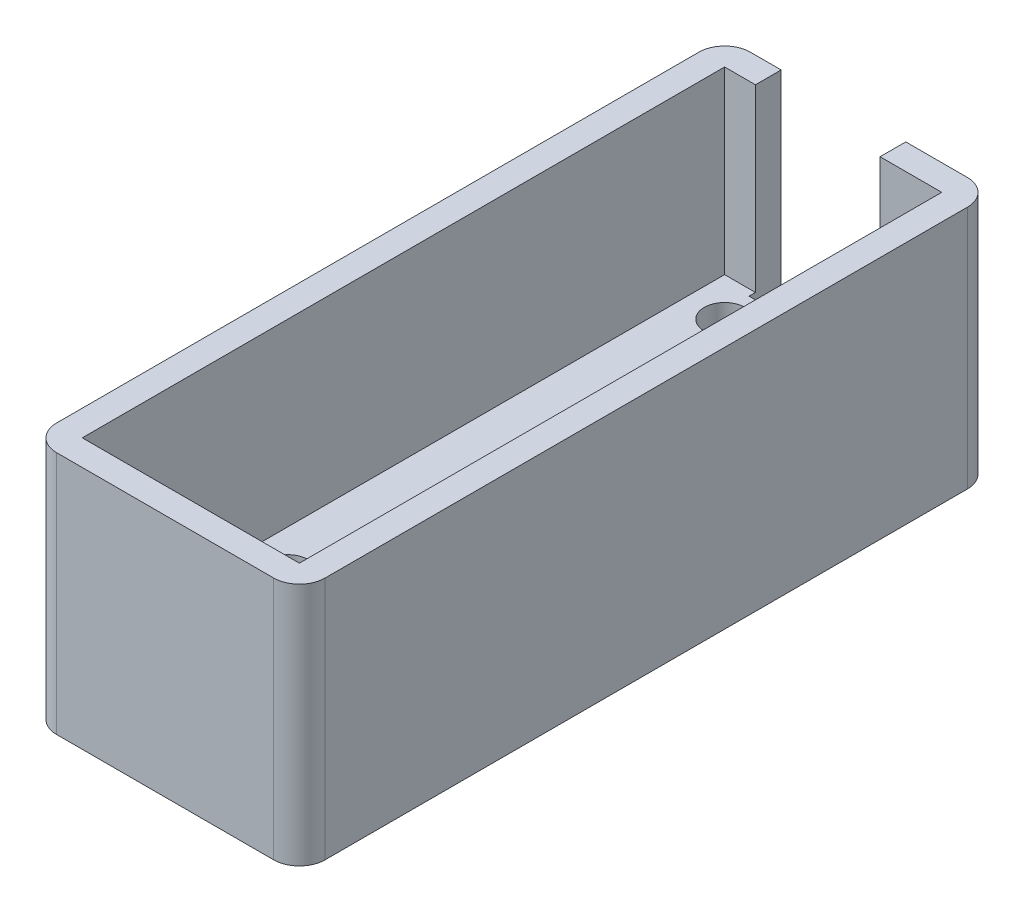
ISO-10303-21;
HEADER;
FILE_DESCRIPTION(('STEP AP214'),'2;1');
FILE_NAME('part.step','',(''),(''),'','','');
FILE_SCHEMA(('AUTOMOTIVE_DESIGN { 1 0 10303 214 1 1 1 1 }'));
ENDSEC;
DATA;
#1=APPLICATION_CONTEXT('core data for automotive mechanical design processes');
#2=APPLICATION_PROTOCOL_DEFINITION('international standard','automotive_design',2000,#1);
#3=PRODUCT_CONTEXT('',#1,'mechanical');
#4=PRODUCT('Part','Part','',(#3));
#5=PRODUCT_RELATED_PRODUCT_CATEGORY('part','',(#4));
#6=PRODUCT_DEFINITION_FORMATION('','',#4);
#7=PRODUCT_DEFINITION_CONTEXT('part definition',#1,'design');
#8=PRODUCT_DEFINITION('design','',#6,#7);
#9=PRODUCT_DEFINITION_SHAPE('','',#8);
#10=(LENGTH_UNIT() NAMED_UNIT(*) SI_UNIT(.MILLI.,.METRE.));
#11=(NAMED_UNIT(*) PLANE_ANGLE_UNIT() SI_UNIT($,.RADIAN.));
#12=(NAMED_UNIT(*) SI_UNIT($,.STERADIAN.) SOLID_ANGLE_UNIT());
#13=UNCERTAINTY_MEASURE_WITH_UNIT(LENGTH_MEASURE(1.E-05),#10,'distance_accuracy_value','');
#14=(GEOMETRIC_REPRESENTATION_CONTEXT(3) GLOBAL_UNCERTAINTY_ASSIGNED_CONTEXT((#13)) GLOBAL_UNIT_ASSIGNED_CONTEXT((#10,
#11,#12)) REPRESENTATION_CONTEXT('',''));
#15=CARTESIAN_POINT('',(0.,0.,0.));
#16=DIRECTION('',(0.,0.,1.));
#17=DIRECTION('',(1.,0.,0.));
#18=AXIS2_PLACEMENT_3D('',#15,#16,#17);
#19=CARTESIAN_POINT('',(21.463,17.78,0.));
#20=DIRECTION('',(1.,0.,0.));
#21=DIRECTION('',(0.,0.,-1.));
#22=AXIS2_PLACEMENT_3D('',#19,#20,#21);
#23=PLANE('',#22);
#24=DIRECTION('',(0.,-1.,0.));
#25=VECTOR('',#24,1.);
#26=CARTESIAN_POINT('',(21.463,5.08,-12.7));
#27=LINE('',#26,#25);
#28=CARTESIAN_POINT('',(21.463,2.54,-12.7));
#29=VERTEX_POINT('',#28);
#30=CARTESIAN_POINT('',(21.463,0.,-12.7));
#31=VERTEX_POINT('',#30);
#32=EDGE_CURVE('E304',#29,#31,#27,.T.);
#33=ORIENTED_EDGE('',*,*,#32,.F.);
#34=CARTESIAN_POINT('',(21.463,2.54,-10.16));
#35=DIRECTION('',(1.,0.,0.));
#36=DIRECTION('',(0.,0.,-1.));
#37=AXIS2_PLACEMENT_3D('',#34,#35,#36);
#38=CIRCLE('',#37,2.54);
#39=CARTESIAN_POINT('',(21.463,5.08,-10.16));
#40=VERTEX_POINT('',#39);
#41=EDGE_CURVE('E11',#29,#40,#38,.T.);
#42=ORIENTED_EDGE('',*,*,#41,.T.);
#43=DIRECTION('',(0.,0.,-1.));
#44=VECTOR('',#43,1.);
#45=CARTESIAN_POINT('',(21.463,5.08,0.));
#46=LINE('',#45,#44);
#47=CARTESIAN_POINT('',(21.463,5.08,0.));
#48=VERTEX_POINT('',#47);
#49=EDGE_CURVE('E210',#48,#40,#46,.T.);
#50=ORIENTED_EDGE('',*,*,#49,.F.);
#51=DIRECTION('',(0.,-1.,0.));
#52=VECTOR('',#51,1.);
#53=CARTESIAN_POINT('',(21.463,17.78,0.));
#54=LINE('',#53,#52);
#55=CARTESIAN_POINT('',(21.463,17.78,0.));
#56=VERTEX_POINT('',#55);
#57=EDGE_CURVE('E209',#56,#48,#54,.T.);
#58=ORIENTED_EDGE('',*,*,#57,.F.);
#59=DIRECTION('',(0.,0.,1.));
#60=VECTOR('',#59,1.);
#61=CARTESIAN_POINT('',(21.463,17.78,0.));
#62=LINE('',#61,#60);
#63=CARTESIAN_POINT('',(21.463,17.78,-63.5));
#64=VERTEX_POINT('',#63);
#65=EDGE_CURVE('E367',#64,#56,#62,.T.);
#66=ORIENTED_EDGE('',*,*,#65,.F.);
#67=DIRECTION('',(0.,-1.,0.));
#68=VECTOR('',#67,1.);
#69=CARTESIAN_POINT('',(21.463,17.78,-63.5));
#70=LINE('',#69,#68);
#71=CARTESIAN_POINT('',(21.463,0.,-63.5));
#72=VERTEX_POINT('',#71);
#73=EDGE_CURVE('E218',#64,#72,#70,.T.);
#74=ORIENTED_EDGE('',*,*,#73,.T.);
#75=DIRECTION('',(0.,0.,1.));
#76=VECTOR('',#75,1.);
#77=CARTESIAN_POINT('',(21.463,0.,0.));
#78=LINE('',#77,#76);
#79=EDGE_CURVE('E375',#72,#31,#78,.T.);
#80=ORIENTED_EDGE('',*,*,#79,.T.);
#81=EDGE_LOOP('',(#33,#42,#50,#58,#66,#74,#80));
#82=FACE_BOUND('',#81,.T.);
#83=ADVANCED_FACE('F49',(#82),#23,.F.);
#84=CARTESIAN_POINT('',(0.,17.78,0.));
#85=DIRECTION('',(-1.,0.,0.));
#86=DIRECTION('',(0.,0.,1.));
#87=AXIS2_PLACEMENT_3D('',#84,#85,#86);
#88=PLANE('',#87);
#89=DIRECTION('',(0.,0.,1.));
#90=VECTOR('',#89,1.);
#91=CARTESIAN_POINT('',(0.,5.08,-12.7));
#92=LINE('',#91,#90);
#93=CARTESIAN_POINT('',(0.,5.08,-10.16));
#94=VERTEX_POINT('',#93);
#95=CARTESIAN_POINT('',(0.,5.08,0.));
#96=VERTEX_POINT('',#95);
#97=EDGE_CURVE('E191',#94,#96,#92,.T.);
#98=ORIENTED_EDGE('',*,*,#97,.F.);
#99=CARTESIAN_POINT('',(0.,2.54,-10.16));
#100=DIRECTION('',(-1.,0.,0.));
#101=DIRECTION('',(0.,0.,1.));
#102=AXIS2_PLACEMENT_3D('',#99,#100,#101);
#103=CIRCLE('',#102,2.54);
#104=CARTESIAN_POINT('',(0.,2.54,-12.7));
#105=VERTEX_POINT('',#104);
#106=EDGE_CURVE('E58',#94,#105,#103,.T.);
#107=ORIENTED_EDGE('',*,*,#106,.T.);
#108=DIRECTION('',(0.,-1.,0.));
#109=VECTOR('',#108,1.);
#110=CARTESIAN_POINT('',(0.,5.08,-12.7));
#111=LINE('',#110,#109);
#112=CARTESIAN_POINT('',(0.,0.,-12.7));
#113=VERTEX_POINT('',#112);
#114=EDGE_CURVE('E300',#105,#113,#111,.T.);
#115=ORIENTED_EDGE('',*,*,#114,.T.);
#116=DIRECTION('',(0.,0.,-1.));
#117=VECTOR('',#116,1.);
#118=CARTESIAN_POINT('',(0.,0.,0.));
#119=LINE('',#118,#117);
#120=CARTESIAN_POINT('',(0.,0.,-63.5));
#121=VERTEX_POINT('',#120);
#122=EDGE_CURVE('E354',#113,#121,#119,.T.);
#123=ORIENTED_EDGE('',*,*,#122,.T.);
#124=DIRECTION('',(0.,-1.,0.));
#125=VECTOR('',#124,1.);
#126=CARTESIAN_POINT('',(0.,17.78,-63.5));
#127=LINE('',#126,#125);
#128=CARTESIAN_POINT('',(0.,17.78,-63.5));
#129=VERTEX_POINT('',#128);
#130=EDGE_CURVE('E216',#129,#121,#127,.T.);
#131=ORIENTED_EDGE('',*,*,#130,.F.);
#132=DIRECTION('',(0.,0.,-1.));
#133=VECTOR('',#132,1.);
#134=CARTESIAN_POINT('',(0.,17.78,0.));
#135=LINE('',#134,#133);
#136=CARTESIAN_POINT('',(0.,17.78,0.));
#137=VERTEX_POINT('',#136);
#138=EDGE_CURVE('E214',#137,#129,#135,.T.);
#139=ORIENTED_EDGE('',*,*,#138,.F.);
#140=DIRECTION('',(0.,-1.,0.));
#141=VECTOR('',#140,1.);
#142=CARTESIAN_POINT('',(0.,17.78,0.));
#143=LINE('',#142,#141);
#144=EDGE_CURVE('E206',#137,#96,#143,.T.);
#145=ORIENTED_EDGE('',*,*,#144,.T.);
#146=EDGE_LOOP('',(#98,#107,#115,#123,#131,#139,#145));
#147=FACE_BOUND('',#146,.T.);
#148=ADVANCED_FACE('F212',(#147),#88,.F.);
#149=CARTESIAN_POINT('',(0.,0.,0.));
#150=DIRECTION('',(0.,1.,0.));
#151=DIRECTION('',(0.,0.,1.));
#152=AXIS2_PLACEMENT_3D('',#149,#150,#151);
#153=PLANE('',#152);
#154=CARTESIAN_POINT('',(3.81,0.,-16.51));
#155=DIRECTION('',(0.,1.,0.));
#156=DIRECTION('',(0.,0.,1.));
#157=AXIS2_PLACEMENT_3D('',#154,#155,#156);
#158=CIRCLE('',#157,2.0193);
#159=CARTESIAN_POINT('',(3.81,0.,-14.4907));
#160=VERTEX_POINT('',#159);
#161=EDGE_CURVE('E773',#160,#160,#158,.T.);
#162=ORIENTED_EDGE('',*,*,#161,.F.);
#163=EDGE_LOOP('',(#162));
#164=FACE_BOUND('',#163,.T.);
#165=CARTESIAN_POINT('',(17.653,0.,-16.51));
#166=DIRECTION('',(0.,1.,0.));
#167=DIRECTION('',(0.,0.,1.));
#168=AXIS2_PLACEMENT_3D('',#165,#166,#167);
#169=CIRCLE('',#168,2.0193);
#170=CARTESIAN_POINT('',(17.653,0.,-14.4907));
#171=VERTEX_POINT('',#170);
#172=EDGE_CURVE('E290',#171,#171,#169,.T.);
#173=ORIENTED_EDGE('',*,*,#172,.F.);
#174=EDGE_LOOP('',(#173));
#175=FACE_BOUND('',#174,.T.);
#176=CARTESIAN_POINT('',(17.653,0.,-59.69));
#177=DIRECTION('',(0.,1.,0.));
#178=DIRECTION('',(0.,0.,1.));
#179=AXIS2_PLACEMENT_3D('',#176,#177,#178);
#180=CIRCLE('',#179,2.0193);
#181=CARTESIAN_POINT('',(17.653,0.,-57.6707));
#182=VERTEX_POINT('',#181);
#183=EDGE_CURVE('E279',#182,#182,#180,.T.);
#184=ORIENTED_EDGE('',*,*,#183,.F.);
#185=EDGE_LOOP('',(#184));
#186=FACE_BOUND('',#185,.T.);
#187=CARTESIAN_POINT('',(3.81,0.,-59.69));
#188=DIRECTION('',(0.,1.,0.));
#189=DIRECTION('',(0.,0.,1.));
#190=AXIS2_PLACEMENT_3D('',#187,#188,#189);
#191=CIRCLE('',#190,2.0193);
#192=CARTESIAN_POINT('',(3.81,0.,-57.6707));
#193=VERTEX_POINT('',#192);
#194=EDGE_CURVE('E276',#193,#193,#191,.T.);
#195=ORIENTED_EDGE('',*,*,#194,.F.);
#196=EDGE_LOOP('',(#195));
#197=FACE_BOUND('',#196,.T.);
#198=ORIENTED_EDGE('',*,*,#122,.F.);
#199=DIRECTION('',(-1.,0.,0.));
#200=VECTOR('',#199,1.);
#201=CARTESIAN_POINT('',(0.,0.,-12.7));
#202=LINE('',#201,#200);
#203=EDGE_CURVE('E200',#31,#113,#202,.T.);
#204=ORIENTED_EDGE('',*,*,#203,.F.);
#205=ORIENTED_EDGE('',*,*,#79,.F.);
#206=DIRECTION('',(1.,0.,0.));
#207=VECTOR('',#206,1.);
#208=CARTESIAN_POINT('',(0.,0.,-63.5));
#209=LINE('',#208,#207);
#210=CARTESIAN_POINT('',(15.367,0.,-63.5));
#211=VERTEX_POINT('',#210);
#212=EDGE_CURVE('E349',#211,#72,#209,.T.);
#213=ORIENTED_EDGE('',*,*,#212,.F.);
#214=DIRECTION('',(0.,0.,-1.));
#215=VECTOR('',#214,1.);
#216=CARTESIAN_POINT('',(15.367,0.,0.));
#217=LINE('',#216,#215);
#218=CARTESIAN_POINT('',(15.367,0.,-62.865));
#219=VERTEX_POINT('',#218);
#220=EDGE_CURVE('E232',#219,#211,#217,.T.);
#221=ORIENTED_EDGE('',*,*,#220,.F.);
#222=DIRECTION('',(-1.,0.,0.));
#223=VECTOR('',#222,1.);
#224=CARTESIAN_POINT('',(0.,0.,-62.865));
#225=LINE('',#224,#223);
#226=CARTESIAN_POINT('',(3.048,0.,-62.865));
#227=VERTEX_POINT('',#226);
#228=EDGE_CURVE('E226',#219,#227,#225,.T.);
#229=ORIENTED_EDGE('',*,*,#228,.T.);
#230=DIRECTION('',(0.,0.,1.));
#231=VECTOR('',#230,1.);
#232=CARTESIAN_POINT('',(3.048,0.,0.));
#233=LINE('',#232,#231);
#234=CARTESIAN_POINT('',(3.048,0.,-63.5));
#235=VERTEX_POINT('',#234);
#236=EDGE_CURVE('E229',#235,#227,#233,.T.);
#237=ORIENTED_EDGE('',*,*,#236,.F.);
#238=EDGE_CURVE('E372',#121,#235,#209,.T.);
#239=ORIENTED_EDGE('',*,*,#238,.F.);
#240=EDGE_LOOP('',(#198,#204,#205,#213,#221,#229,#237,#239));
#241=FACE_BOUND('',#240,.T.);
#242=ADVANCED_FACE('F383',(#164,#175,#186,#197,#241),#153,.T.);
#243=CARTESIAN_POINT('',(0.,17.78,-63.5));
#244=DIRECTION('',(0.,0.,-1.));
#245=DIRECTION('',(-1.,0.,0.));
#246=AXIS2_PLACEMENT_3D('',#243,#244,#245);
#247=PLANE('',#246);
#248=DIRECTION('',(1.,0.,0.));
#249=VECTOR('',#248,1.);
#250=CARTESIAN_POINT('',(0.,17.78,-63.5));
#251=LINE('',#250,#249);
#252=CARTESIAN_POINT('',(15.367,17.78,-63.5));
#253=VERTEX_POINT('',#252);
#254=EDGE_CURVE('E363',#253,#64,#251,.T.);
#255=ORIENTED_EDGE('',*,*,#254,.F.);
#256=DIRECTION('',(0.,-1.,0.));
#257=VECTOR('',#256,1.);
#258=CARTESIAN_POINT('',(15.367,17.78,-63.5));
#259=LINE('',#258,#257);
#260=EDGE_CURVE('E334',#253,#211,#259,.T.);
#261=ORIENTED_EDGE('',*,*,#260,.T.);
#262=ORIENTED_EDGE('',*,*,#212,.T.);
#263=ORIENTED_EDGE('',*,*,#73,.F.);
#264=EDGE_LOOP('',(#255,#261,#262,#263));
#265=FACE_BOUND('',#264,.T.);
#266=ADVANCED_FACE('F422',(#265),#247,.F.);
#267=ORIENTED_EDGE('',*,*,#238,.T.);
#268=DIRECTION('',(0.,1.,0.));
#269=VECTOR('',#268,1.);
#270=CARTESIAN_POINT('',(3.048,17.78,-63.5));
#271=LINE('',#270,#269);
#272=CARTESIAN_POINT('',(3.048,17.78,-63.5));
#273=VERTEX_POINT('',#272);
#274=EDGE_CURVE('E325',#235,#273,#271,.T.);
#275=ORIENTED_EDGE('',*,*,#274,.T.);
#276=EDGE_CURVE('E364',#129,#273,#251,.T.);
#277=ORIENTED_EDGE('',*,*,#276,.F.);
#278=ORIENTED_EDGE('',*,*,#130,.T.);
#279=EDGE_LOOP('',(#267,#275,#277,#278));
#280=FACE_BOUND('',#279,.T.);
#281=ADVANCED_FACE('F385',(#280),#247,.F.);
#282=CARTESIAN_POINT('',(0.,17.78,0.));
#283=DIRECTION('',(0.,0.,-1.));
#284=DIRECTION('',(-1.,0.,0.));
#285=AXIS2_PLACEMENT_3D('',#282,#283,#284);
#286=PLANE('',#285);
#287=DIRECTION('',(1.,0.,0.));
#288=VECTOR('',#287,1.);
#289=CARTESIAN_POINT('',(0.,5.08,0.));
#290=LINE('',#289,#288);
#291=EDGE_CURVE('E195',#96,#48,#290,.T.);
#292=ORIENTED_EDGE('',*,*,#291,.F.);
#293=ORIENTED_EDGE('',*,*,#144,.F.);
#294=DIRECTION('',(1.,0.,0.));
#295=VECTOR('',#294,1.);
#296=CARTESIAN_POINT('',(0.,17.78,0.));
#297=LINE('',#296,#295);
#298=EDGE_CURVE('E369',#137,#56,#297,.T.);
#299=ORIENTED_EDGE('',*,*,#298,.T.);
#300=ORIENTED_EDGE('',*,*,#57,.T.);
#301=EDGE_LOOP('',(#292,#293,#299,#300));
#302=FACE_BOUND('',#301,.T.);
#303=ADVANCED_FACE('F204',(#302),#286,.T.);
#304=CARTESIAN_POINT('',(-2.54,17.78,0.));
#305=DIRECTION('',(-1.,0.,0.));
#306=DIRECTION('',(0.,0.,1.));
#307=AXIS2_PLACEMENT_3D('',#304,#305,#306);
#308=PLANE('',#307);
#309=DIRECTION('',(0.,0.,-1.));
#310=VECTOR('',#309,1.);
#311=CARTESIAN_POINT('',(-2.54,17.78,0.));
#312=LINE('',#311,#310);
#313=CARTESIAN_POINT('',(-2.54,17.78,0.));
#314=VERTEX_POINT('',#313);
#315=CARTESIAN_POINT('',(-2.54,17.78,-63.5));
#316=VERTEX_POINT('',#315);
#317=EDGE_CURVE('E350',#314,#316,#312,.T.);
#318=ORIENTED_EDGE('',*,*,#317,.T.);
#319=DIRECTION('',(0.,-1.,0.));
#320=VECTOR('',#319,1.);
#321=CARTESIAN_POINT('',(-2.54,17.78,-63.5));
#322=LINE('',#321,#320);
#323=CARTESIAN_POINT('',(-2.54,-6.35,-63.5));
#324=VERTEX_POINT('',#323);
#325=EDGE_CURVE('E236',#316,#324,#322,.T.);
#326=ORIENTED_EDGE('',*,*,#325,.T.);
#327=DIRECTION('',(0.,0.,-1.));
#328=VECTOR('',#327,1.);
#329=CARTESIAN_POINT('',(-2.54,-6.35,0.));
#330=LINE('',#329,#328);
#331=CARTESIAN_POINT('',(-2.54,-6.35,0.));
#332=VERTEX_POINT('',#331);
#333=EDGE_CURVE('E337',#332,#324,#330,.T.);
#334=ORIENTED_EDGE('',*,*,#333,.F.);
#335=DIRECTION('',(0.,-1.,0.));
#336=VECTOR('',#335,1.);
#337=CARTESIAN_POINT('',(-2.54,17.78,0.));
#338=LINE('',#337,#336);
#339=EDGE_CURVE('E234',#332,#314,#338,.F.);
#340=ORIENTED_EDGE('',*,*,#339,.T.);
#341=EDGE_LOOP('',(#318,#326,#334,#340));
#342=FACE_BOUND('',#341,.T.);
#343=ADVANCED_FACE('F434',(#342),#308,.T.);
#344=CARTESIAN_POINT('',(0.,17.78,2.54));
#345=DIRECTION('',(0.,0.,-1.));
#346=DIRECTION('',(-1.,0.,0.));
#347=AXIS2_PLACEMENT_3D('',#344,#345,#346);
#348=PLANE('',#347);
#349=DIRECTION('',(1.,0.,0.));
#350=VECTOR('',#349,1.);
#351=CARTESIAN_POINT('',(0.,-6.35,2.54));
#352=LINE('',#351,#350);
#353=CARTESIAN_POINT('',(0.,-6.35,2.54));
#354=VERTEX_POINT('',#353);
#355=CARTESIAN_POINT('',(21.463,-6.35,2.54));
#356=VERTEX_POINT('',#355);
#357=EDGE_CURVE('E340',#354,#356,#352,.T.);
#358=ORIENTED_EDGE('',*,*,#357,.T.);
#359=DIRECTION('',(0.,-1.,0.));
#360=VECTOR('',#359,1.);
#361=CARTESIAN_POINT('',(21.463,17.78,2.54));
#362=LINE('',#361,#360);
#363=CARTESIAN_POINT('',(21.463,17.78,2.54));
#364=VERTEX_POINT('',#363);
#365=EDGE_CURVE('E270',#356,#364,#362,.F.);
#366=ORIENTED_EDGE('',*,*,#365,.T.);
#367=DIRECTION('',(1.,0.,0.));
#368=VECTOR('',#367,1.);
#369=CARTESIAN_POINT('',(0.,17.78,2.54));
#370=LINE('',#369,#368);
#371=CARTESIAN_POINT('',(0.,17.78,2.54));
#372=VERTEX_POINT('',#371);
#373=EDGE_CURVE('E353',#372,#364,#370,.T.);
#374=ORIENTED_EDGE('',*,*,#373,.F.);
#375=DIRECTION('',(0.,-1.,0.));
#376=VECTOR('',#375,1.);
#377=CARTESIAN_POINT('',(0.,-6.35,2.54));
#378=LINE('',#377,#376);
#379=EDGE_CURVE('E267',#372,#354,#378,.T.);
#380=ORIENTED_EDGE('',*,*,#379,.T.);
#381=EDGE_LOOP('',(#358,#366,#374,#380));
#382=FACE_BOUND('',#381,.T.);
#383=ADVANCED_FACE('F430',(#382),#348,.F.);
#384=CARTESIAN_POINT('',(24.003,17.78,0.));
#385=DIRECTION('',(1.,0.,0.));
#386=DIRECTION('',(0.,0.,-1.));
#387=AXIS2_PLACEMENT_3D('',#384,#385,#386);
#388=PLANE('',#387);
#389=DIRECTION('',(0.,0.,1.));
#390=VECTOR('',#389,1.);
#391=CARTESIAN_POINT('',(24.003,-6.35,0.));
#392=LINE('',#391,#390);
#393=CARTESIAN_POINT('',(24.003,-6.35,-63.5));
#394=VERTEX_POINT('',#393);
#395=CARTESIAN_POINT('',(24.003,-6.35,0.));
#396=VERTEX_POINT('',#395);
#397=EDGE_CURVE('E343',#394,#396,#392,.T.);
#398=ORIENTED_EDGE('',*,*,#397,.F.);
#399=DIRECTION('',(0.,-1.,0.));
#400=VECTOR('',#399,1.);
#401=CARTESIAN_POINT('',(24.003,17.78,-63.5));
#402=LINE('',#401,#400);
#403=CARTESIAN_POINT('',(24.003,17.78,-63.5));
#404=VERTEX_POINT('',#403);
#405=EDGE_CURVE('E265',#394,#404,#402,.F.);
#406=ORIENTED_EDGE('',*,*,#405,.T.);
#407=DIRECTION('',(0.,0.,1.));
#408=VECTOR('',#407,1.);
#409=CARTESIAN_POINT('',(24.003,17.78,0.));
#410=LINE('',#409,#408);
#411=CARTESIAN_POINT('',(24.003,17.78,0.));
#412=VERTEX_POINT('',#411);
#413=EDGE_CURVE('E357',#404,#412,#410,.T.);
#414=ORIENTED_EDGE('',*,*,#413,.T.);
#415=DIRECTION('',(0.,-1.,0.));
#416=VECTOR('',#415,1.);
#417=CARTESIAN_POINT('',(24.003,-6.35,0.));
#418=LINE('',#417,#416);
#419=EDGE_CURVE('E262',#412,#396,#418,.T.);
#420=ORIENTED_EDGE('',*,*,#419,.T.);
#421=EDGE_LOOP('',(#398,#406,#414,#420));
#422=FACE_BOUND('',#421,.T.);
#423=ADVANCED_FACE('F426',(#422),#388,.T.);
#424=CARTESIAN_POINT('',(0.,17.78,-66.04));
#425=DIRECTION('',(0.,0.,-1.));
#426=DIRECTION('',(-1.,0.,0.));
#427=AXIS2_PLACEMENT_3D('',#424,#425,#426);
#428=PLANE('',#427);
#429=DIRECTION('',(1.,0.,0.));
#430=VECTOR('',#429,1.);
#431=CARTESIAN_POINT('',(0.,-6.35,-66.04));
#432=LINE('',#431,#430);
#433=CARTESIAN_POINT('',(0.,-6.35,-66.04));
#434=VERTEX_POINT('',#433);
#435=CARTESIAN_POINT('',(21.463,-6.35,-66.04));
#436=VERTEX_POINT('',#435);
#437=EDGE_CURVE('E346',#434,#436,#432,.T.);
#438=ORIENTED_EDGE('',*,*,#437,.F.);
#439=DIRECTION('',(0.,-1.,0.));
#440=VECTOR('',#439,1.);
#441=CARTESIAN_POINT('',(0.,17.78,-66.04));
#442=LINE('',#441,#440);
#443=CARTESIAN_POINT('',(0.,17.78,-66.04));
#444=VERTEX_POINT('',#443);
#445=EDGE_CURVE('E250',#434,#444,#442,.F.);
#446=ORIENTED_EDGE('',*,*,#445,.T.);
#447=DIRECTION('',(1.,0.,0.));
#448=VECTOR('',#447,1.);
#449=CARTESIAN_POINT('',(0.,17.78,-66.04));
#450=LINE('',#449,#448);
#451=CARTESIAN_POINT('',(3.048,17.78,-66.04));
#452=VERTEX_POINT('',#451);
#453=EDGE_CURVE('E361',#444,#452,#450,.T.);
#454=ORIENTED_EDGE('',*,*,#453,.T.);
#455=DIRECTION('',(0.,1.,0.));
#456=VECTOR('',#455,1.);
#457=CARTESIAN_POINT('',(3.048,17.78,-66.04));
#458=LINE('',#457,#456);
#459=CARTESIAN_POINT('',(3.048,-0.635,-66.04));
#460=VERTEX_POINT('',#459);
#461=EDGE_CURVE('E310',#460,#452,#458,.T.);
#462=ORIENTED_EDGE('',*,*,#461,.F.);
#463=DIRECTION('',(-1.,0.,0.));
#464=VECTOR('',#463,1.);
#465=CARTESIAN_POINT('',(15.367,-0.635,-66.04));
#466=LINE('',#465,#464);
#467=CARTESIAN_POINT('',(15.367,-0.635,-66.04));
#468=VERTEX_POINT('',#467);
#469=EDGE_CURVE('E318',#468,#460,#466,.T.);
#470=ORIENTED_EDGE('',*,*,#469,.F.);
#471=DIRECTION('',(0.,-1.,0.));
#472=VECTOR('',#471,1.);
#473=CARTESIAN_POINT('',(15.367,17.78,-66.04));
#474=LINE('',#473,#472);
#475=CARTESIAN_POINT('',(15.367,17.78,-66.04));
#476=VERTEX_POINT('',#475);
#477=EDGE_CURVE('E306',#476,#468,#474,.T.);
#478=ORIENTED_EDGE('',*,*,#477,.F.);
#479=CARTESIAN_POINT('',(21.463,17.78,-66.04));
#480=VERTEX_POINT('',#479);
#481=EDGE_CURVE('E360',#476,#480,#450,.T.);
#482=ORIENTED_EDGE('',*,*,#481,.T.);
#483=DIRECTION('',(0.,-1.,0.));
#484=VECTOR('',#483,1.);
#485=CARTESIAN_POINT('',(21.463,17.78,-66.04));
#486=LINE('',#485,#484);
#487=EDGE_CURVE('E247',#480,#436,#486,.T.);
#488=ORIENTED_EDGE('',*,*,#487,.T.);
#489=EDGE_LOOP('',(#438,#446,#454,#462,#470,#478,#482,#488));
#490=FACE_BOUND('',#489,.T.);
#491=ADVANCED_FACE('F423',(#490),#428,.T.);
#492=CARTESIAN_POINT('',(0.,17.78,0.));
#493=DIRECTION('',(0.,1.,0.));
#494=DIRECTION('',(0.,0.,1.));
#495=AXIS2_PLACEMENT_3D('',#492,#493,#494);
#496=PLANE('',#495);
#497=ORIENTED_EDGE('',*,*,#453,.F.);
#498=CARTESIAN_POINT('',(0.,17.78,-63.5));
#499=DIRECTION('',(0.,1.,0.));
#500=DIRECTION('',(0.,0.,1.));
#501=AXIS2_PLACEMENT_3D('',#498,#499,#500);
#502=CIRCLE('',#501,2.54);
#503=EDGE_CURVE('E258',#444,#316,#502,.T.);
#504=ORIENTED_EDGE('',*,*,#503,.T.);
#505=ORIENTED_EDGE('',*,*,#317,.F.);
#506=CARTESIAN_POINT('',(0.,17.78,0.));
#507=DIRECTION('',(0.,1.,0.));
#508=DIRECTION('',(0.,0.,1.));
#509=AXIS2_PLACEMENT_3D('',#506,#507,#508);
#510=CIRCLE('',#509,2.54);
#511=EDGE_CURVE('E252',#314,#372,#510,.T.);
#512=ORIENTED_EDGE('',*,*,#511,.T.);
#513=ORIENTED_EDGE('',*,*,#373,.T.);
#514=CARTESIAN_POINT('',(21.463,17.78,0.));
#515=DIRECTION('',(0.,1.,0.));
#516=DIRECTION('',(0.,0.,1.));
#517=AXIS2_PLACEMENT_3D('',#514,#515,#516);
#518=CIRCLE('',#517,2.54);
#519=EDGE_CURVE('E254',#364,#412,#518,.T.);
#520=ORIENTED_EDGE('',*,*,#519,.T.);
#521=ORIENTED_EDGE('',*,*,#413,.F.);
#522=CARTESIAN_POINT('',(21.463,17.78,-63.5));
#523=DIRECTION('',(0.,1.,0.));
#524=DIRECTION('',(0.,0.,1.));
#525=AXIS2_PLACEMENT_3D('',#522,#523,#524);
#526=CIRCLE('',#525,2.54);
#527=EDGE_CURVE('E256',#404,#480,#526,.T.);
#528=ORIENTED_EDGE('',*,*,#527,.T.);
#529=ORIENTED_EDGE('',*,*,#481,.F.);
#530=DIRECTION('',(0.,0.,-1.));
#531=VECTOR('',#530,1.);
#532=CARTESIAN_POINT('',(15.367,17.78,-62.865));
#533=LINE('',#532,#531);
#534=EDGE_CURVE('E323',#253,#476,#533,.T.);
#535=ORIENTED_EDGE('',*,*,#534,.F.);
#536=ORIENTED_EDGE('',*,*,#254,.T.);
#537=ORIENTED_EDGE('',*,*,#65,.T.);
#538=ORIENTED_EDGE('',*,*,#298,.F.);
#539=ORIENTED_EDGE('',*,*,#138,.T.);
#540=ORIENTED_EDGE('',*,*,#276,.T.);
#541=DIRECTION('',(0.,0.,-1.));
#542=VECTOR('',#541,1.);
#543=CARTESIAN_POINT('',(3.048,17.78,-62.865));
#544=LINE('',#543,#542);
#545=EDGE_CURVE('E326',#273,#452,#544,.T.);
#546=ORIENTED_EDGE('',*,*,#545,.T.);
#547=EDGE_LOOP('',(#497,#504,#505,#512,#513,#520,#521,#528,#529,#535,#536,#537,#538,#539,#540,#546));
#548=FACE_BOUND('',#547,.T.);
#549=ADVANCED_FACE('F388',(#548),#496,.T.);
#550=CARTESIAN_POINT('',(0.,-6.35,0.));
#551=DIRECTION('',(0.,1.,0.));
#552=DIRECTION('',(0.,0.,1.));
#553=AXIS2_PLACEMENT_3D('',#550,#551,#552);
#554=PLANE('',#553);
#555=CARTESIAN_POINT('',(3.81,-6.35,-16.51));
#556=DIRECTION('',(0.,1.,0.));
#557=DIRECTION('',(0.,0.,1.));
#558=AXIS2_PLACEMENT_3D('',#555,#556,#557);
#559=CIRCLE('',#558,2.0193);
#560=CARTESIAN_POINT('',(3.81,-6.35,-14.4907));
#561=VERTEX_POINT('',#560);
#562=EDGE_CURVE('E53',#561,#561,#559,.T.);
#563=ORIENTED_EDGE('',*,*,#562,.T.);
#564=EDGE_LOOP('',(#563));
#565=FACE_BOUND('',#564,.T.);
#566=CARTESIAN_POINT('',(17.653,-6.35,-16.51));
#567=DIRECTION('',(0.,1.,0.));
#568=DIRECTION('',(0.,0.,1.));
#569=AXIS2_PLACEMENT_3D('',#566,#567,#568);
#570=CIRCLE('',#569,2.0193);
#571=CARTESIAN_POINT('',(17.653,-6.35,-14.4907));
#572=VERTEX_POINT('',#571);
#573=EDGE_CURVE('E285',#572,#572,#570,.T.);
#574=ORIENTED_EDGE('',*,*,#573,.T.);
#575=EDGE_LOOP('',(#574));
#576=FACE_BOUND('',#575,.T.);
#577=CARTESIAN_POINT('',(17.653,-6.35,-59.69));
#578=DIRECTION('',(0.,1.,0.));
#579=DIRECTION('',(0.,0.,1.));
#580=AXIS2_PLACEMENT_3D('',#577,#578,#579);
#581=CIRCLE('',#580,2.0193);
#582=CARTESIAN_POINT('',(17.653,-6.35,-57.6707));
#583=VERTEX_POINT('',#582);
#584=EDGE_CURVE('E277',#583,#583,#581,.T.);
#585=ORIENTED_EDGE('',*,*,#584,.T.);
#586=EDGE_LOOP('',(#585));
#587=FACE_BOUND('',#586,.T.);
#588=CARTESIAN_POINT('',(3.81,-6.35,-59.69));
#589=DIRECTION('',(0.,1.,0.));
#590=DIRECTION('',(0.,0.,1.));
#591=AXIS2_PLACEMENT_3D('',#588,#589,#590);
#592=CIRCLE('',#591,2.0193);
#593=CARTESIAN_POINT('',(3.81,-6.35,-57.6707));
#594=VERTEX_POINT('',#593);
#595=EDGE_CURVE('E273',#594,#594,#592,.T.);
#596=ORIENTED_EDGE('',*,*,#595,.T.);
#597=EDGE_LOOP('',(#596));
#598=FACE_BOUND('',#597,.T.);
#599=CARTESIAN_POINT('',(9.23150000000002,-6.35,-4.44755638057864));
#600=DIRECTION('',(0.,1.,0.));
#601=DIRECTION('',(0.,0.,1.));
#602=AXIS2_PLACEMENT_3D('',#599,#600,#601);
#603=CIRCLE('',#602,2.1336);
#604=CARTESIAN_POINT('',(9.23150000000002,-6.35,-2.31395638057864));
#605=VERTEX_POINT('',#604);
#606=EDGE_CURVE('E294',#605,#605,#603,.T.);
#607=ORIENTED_EDGE('',*,*,#606,.T.);
#608=EDGE_LOOP('',(#607));
#609=FACE_BOUND('',#608,.T.);
#610=ORIENTED_EDGE('',*,*,#333,.T.);
#611=CARTESIAN_POINT('',(0.,-6.35,-63.5));
#612=DIRECTION('',(0.,1.,0.));
#613=DIRECTION('',(0.,0.,1.));
#614=AXIS2_PLACEMENT_3D('',#611,#612,#613);
#615=CIRCLE('',#614,2.54);
#616=EDGE_CURVE('E245',#324,#434,#615,.F.);
#617=ORIENTED_EDGE('',*,*,#616,.T.);
#618=ORIENTED_EDGE('',*,*,#437,.T.);
#619=CARTESIAN_POINT('',(21.463,-6.35,-63.5));
#620=DIRECTION('',(0.,1.,0.));
#621=DIRECTION('',(0.,0.,1.));
#622=AXIS2_PLACEMENT_3D('',#619,#620,#621);
#623=CIRCLE('',#622,2.54);
#624=EDGE_CURVE('E243',#436,#394,#623,.F.);
#625=ORIENTED_EDGE('',*,*,#624,.T.);
#626=ORIENTED_EDGE('',*,*,#397,.T.);
#627=CARTESIAN_POINT('',(21.463,-6.35,0.));
#628=DIRECTION('',(0.,1.,0.));
#629=DIRECTION('',(0.,0.,1.));
#630=AXIS2_PLACEMENT_3D('',#627,#628,#629);
#631=CIRCLE('',#630,2.54);
#632=EDGE_CURVE('E241',#396,#356,#631,.F.);
#633=ORIENTED_EDGE('',*,*,#632,.T.);
#634=ORIENTED_EDGE('',*,*,#357,.F.);
#635=CARTESIAN_POINT('',(0.,-6.35,0.));
#636=DIRECTION('',(0.,1.,0.));
#637=DIRECTION('',(0.,0.,1.));
#638=AXIS2_PLACEMENT_3D('',#635,#636,#637);
#639=CIRCLE('',#638,2.54);
#640=EDGE_CURVE('E239',#354,#332,#639,.F.);
#641=ORIENTED_EDGE('',*,*,#640,.T.);
#642=EDGE_LOOP('',(#610,#617,#618,#625,#626,#633,#634,#641));
#643=FACE_BOUND('',#642,.T.);
#644=ADVANCED_FACE('F450',(#565,#576,#587,#598,#609,#643),#554,.F.);
#645=CARTESIAN_POINT('',(15.367,17.78,-62.865));
#646=DIRECTION('',(1.,0.,0.));
#647=DIRECTION('',(0.,1.,0.));
#648=AXIS2_PLACEMENT_3D('',#645,#646,#647);
#649=PLANE('',#648);
#650=ORIENTED_EDGE('',*,*,#534,.T.);
#651=ORIENTED_EDGE('',*,*,#477,.T.);
#652=DIRECTION('',(0.,0.,-1.));
#653=VECTOR('',#652,1.);
#654=CARTESIAN_POINT('',(15.367,-0.635,-62.865));
#655=LINE('',#654,#653);
#656=CARTESIAN_POINT('',(15.367,-0.635,-62.865));
#657=VERTEX_POINT('',#656);
#658=EDGE_CURVE('E315',#657,#468,#655,.T.);
#659=ORIENTED_EDGE('',*,*,#658,.F.);
#660=DIRECTION('',(0.,-1.,0.));
#661=VECTOR('',#660,1.);
#662=CARTESIAN_POINT('',(15.367,17.78,-62.865));
#663=LINE('',#662,#661);
#664=EDGE_CURVE('E307',#219,#657,#663,.T.);
#665=ORIENTED_EDGE('',*,*,#664,.F.);
#666=ORIENTED_EDGE('',*,*,#220,.T.);
#667=ORIENTED_EDGE('',*,*,#260,.F.);
#668=EDGE_LOOP('',(#650,#651,#659,#665,#666,#667));
#669=FACE_BOUND('',#668,.T.);
#670=ADVANCED_FACE('F491',(#669),#649,.F.);
#671=CARTESIAN_POINT('',(3.048,17.78,-62.865));
#672=DIRECTION('',(-1.,0.,0.));
#673=DIRECTION('',(0.,-1.,0.));
#674=AXIS2_PLACEMENT_3D('',#671,#672,#673);
#675=PLANE('',#674);
#676=ORIENTED_EDGE('',*,*,#236,.T.);
#677=DIRECTION('',(0.,1.,0.));
#678=VECTOR('',#677,1.);
#679=CARTESIAN_POINT('',(3.048,17.78,-62.865));
#680=LINE('',#679,#678);
#681=CARTESIAN_POINT('',(3.048,-0.635,-62.865));
#682=VERTEX_POINT('',#681);
#683=EDGE_CURVE('E313',#682,#227,#680,.T.);
#684=ORIENTED_EDGE('',*,*,#683,.F.);
#685=DIRECTION('',(0.,0.,-1.));
#686=VECTOR('',#685,1.);
#687=CARTESIAN_POINT('',(3.048,-0.635,-62.865));
#688=LINE('',#687,#686);
#689=EDGE_CURVE('E329',#682,#460,#688,.T.);
#690=ORIENTED_EDGE('',*,*,#689,.T.);
#691=ORIENTED_EDGE('',*,*,#461,.T.);
#692=ORIENTED_EDGE('',*,*,#545,.F.);
#693=ORIENTED_EDGE('',*,*,#274,.F.);
#694=EDGE_LOOP('',(#676,#684,#690,#691,#692,#693));
#695=FACE_BOUND('',#694,.T.);
#696=ADVANCED_FACE('F488',(#695),#675,.F.);
#697=CARTESIAN_POINT('',(15.367,-0.635,-62.865));
#698=DIRECTION('',(0.,-1.,0.));
#699=DIRECTION('',(0.,0.,-1.));
#700=AXIS2_PLACEMENT_3D('',#697,#698,#699);
#701=PLANE('',#700);
#702=ORIENTED_EDGE('',*,*,#469,.T.);
#703=ORIENTED_EDGE('',*,*,#689,.F.);
#704=DIRECTION('',(-1.,0.,0.));
#705=VECTOR('',#704,1.);
#706=CARTESIAN_POINT('',(15.367,-0.635,-62.865));
#707=LINE('',#706,#705);
#708=EDGE_CURVE('E309',#657,#682,#707,.T.);
#709=ORIENTED_EDGE('',*,*,#708,.F.);
#710=ORIENTED_EDGE('',*,*,#658,.T.);
#711=EDGE_LOOP('',(#702,#703,#709,#710));
#712=FACE_BOUND('',#711,.T.);
#713=ADVANCED_FACE('F483',(#712),#701,.F.);
#714=CARTESIAN_POINT('',(0.,0.,-62.865));
#715=DIRECTION('',(0.,0.,-1.));
#716=DIRECTION('',(-1.,0.,0.));
#717=AXIS2_PLACEMENT_3D('',#714,#715,#716);
#718=PLANE('',#717);
#719=ORIENTED_EDGE('',*,*,#664,.T.);
#720=ORIENTED_EDGE('',*,*,#708,.T.);
#721=ORIENTED_EDGE('',*,*,#683,.T.);
#722=ORIENTED_EDGE('',*,*,#228,.F.);
#723=EDGE_LOOP('',(#719,#720,#721,#722));
#724=FACE_BOUND('',#723,.T.);
#725=ADVANCED_FACE('F474',(#724),#718,.T.);
#726=CARTESIAN_POINT('',(0.,5.08,-12.7));
#727=DIRECTION('',(0.,0.,1.));
#728=DIRECTION('',(1.,0.,0.));
#729=AXIS2_PLACEMENT_3D('',#726,#727,#728);
#730=PLANE('',#729);
#731=ORIENTED_EDGE('',*,*,#114,.F.);
#732=DIRECTION('',(-1.,0.,0.));
#733=VECTOR('',#732,1.);
#734=CARTESIAN_POINT('',(21.463,2.54,-12.7));
#735=LINE('',#734,#733);
#736=EDGE_CURVE('E66',#105,#29,#735,.F.);
#737=ORIENTED_EDGE('',*,*,#736,.T.);
#738=ORIENTED_EDGE('',*,*,#32,.T.);
#739=ORIENTED_EDGE('',*,*,#203,.T.);
#740=EDGE_LOOP('',(#731,#737,#738,#739));
#741=FACE_BOUND('',#740,.T.);
#742=ADVANCED_FACE('F472',(#741),#730,.F.);
#743=CARTESIAN_POINT('',(0.,5.08,0.));
#744=DIRECTION('',(0.,1.,0.));
#745=DIRECTION('',(0.,0.,1.));
#746=AXIS2_PLACEMENT_3D('',#743,#744,#745);
#747=PLANE('',#746);
#748=CARTESIAN_POINT('',(9.23150000000002,5.08,-4.44755638057864));
#749=DIRECTION('',(0.,1.,0.));
#750=DIRECTION('',(0.,0.,1.));
#751=AXIS2_PLACEMENT_3D('',#748,#749,#750);
#752=CIRCLE('',#751,2.1336);
#753=CARTESIAN_POINT('',(9.23150000000002,5.08,-2.31395638057864));
#754=VERTEX_POINT('',#753);
#755=EDGE_CURVE('E275',#754,#754,#752,.T.);
#756=ORIENTED_EDGE('',*,*,#755,.F.);
#757=EDGE_LOOP('',(#756));
#758=FACE_BOUND('',#757,.T.);
#759=ORIENTED_EDGE('',*,*,#49,.T.);
#760=DIRECTION('',(-1.,0.,0.));
#761=VECTOR('',#760,1.);
#762=CARTESIAN_POINT('',(0.,5.08,-10.16));
#763=LINE('',#762,#761);
#764=EDGE_CURVE('E198',#40,#94,#763,.T.);
#765=ORIENTED_EDGE('',*,*,#764,.T.);
#766=ORIENTED_EDGE('',*,*,#97,.T.);
#767=ORIENTED_EDGE('',*,*,#291,.T.);
#768=EDGE_LOOP('',(#759,#765,#766,#767));
#769=FACE_BOUND('',#768,.T.);
#770=ADVANCED_FACE('F194',(#758,#769),#747,.T.);
#771=CARTESIAN_POINT('',(9.23150000000002,-6.35,-4.44755638057864));
#772=DIRECTION('',(0.,1.,0.));
#773=DIRECTION('',(0.,0.,1.));
#774=AXIS2_PLACEMENT_3D('',#771,#772,#773);
#775=CYLINDRICAL_SURFACE('',#774,2.1336);
#776=ORIENTED_EDGE('',*,*,#606,.F.);
#777=EDGE_LOOP('',(#776));
#778=FACE_BOUND('',#777,.T.);
#779=ORIENTED_EDGE('',*,*,#755,.T.);
#780=EDGE_LOOP('',(#779));
#781=FACE_BOUND('',#780,.T.);
#782=ADVANCED_FACE('F408',(#778,#781),#775,.F.);
#783=CARTESIAN_POINT('',(0.,17.78,-63.5));
#784=DIRECTION('',(0.,-1.,0.));
#785=DIRECTION('',(0.,0.,-1.));
#786=AXIS2_PLACEMENT_3D('',#783,#784,#785);
#787=CYLINDRICAL_SURFACE('',#786,2.54);
#788=ORIENTED_EDGE('',*,*,#503,.F.);
#789=ORIENTED_EDGE('',*,*,#445,.F.);
#790=ORIENTED_EDGE('',*,*,#616,.F.);
#791=ORIENTED_EDGE('',*,*,#325,.F.);
#792=EDGE_LOOP('',(#788,#789,#790,#791));
#793=FACE_BOUND('',#792,.T.);
#794=ADVANCED_FACE('F399',(#793),#787,.T.);
#795=CARTESIAN_POINT('',(0.,2.54,-10.16));
#796=DIRECTION('',(1.,0.,0.));
#797=DIRECTION('',(0.,0.,-1.));
#798=AXIS2_PLACEMENT_3D('',#795,#796,#797);
#799=CYLINDRICAL_SURFACE('',#798,2.54);
#800=ORIENTED_EDGE('',*,*,#41,.F.);
#801=ORIENTED_EDGE('',*,*,#736,.F.);
#802=ORIENTED_EDGE('',*,*,#106,.F.);
#803=ORIENTED_EDGE('',*,*,#764,.F.);
#804=EDGE_LOOP('',(#800,#801,#802,#803));
#805=FACE_BOUND('',#804,.T.);
#806=ADVANCED_FACE('F396',(#805),#799,.T.);
#807=CARTESIAN_POINT('',(21.463,17.78,-63.5));
#808=DIRECTION('',(0.,-1.,0.));
#809=DIRECTION('',(0.,0.,-1.));
#810=AXIS2_PLACEMENT_3D('',#807,#808,#809);
#811=CYLINDRICAL_SURFACE('',#810,2.54);
#812=ORIENTED_EDGE('',*,*,#527,.F.);
#813=ORIENTED_EDGE('',*,*,#405,.F.);
#814=ORIENTED_EDGE('',*,*,#624,.F.);
#815=ORIENTED_EDGE('',*,*,#487,.F.);
#816=EDGE_LOOP('',(#812,#813,#814,#815));
#817=FACE_BOUND('',#816,.T.);
#818=ADVANCED_FACE('F398',(#817),#811,.T.);
#819=CARTESIAN_POINT('',(21.463,17.78,0.));
#820=DIRECTION('',(0.,1.,0.));
#821=DIRECTION('',(0.,0.,1.));
#822=AXIS2_PLACEMENT_3D('',#819,#820,#821);
#823=CYLINDRICAL_SURFACE('',#822,2.54);
#824=ORIENTED_EDGE('',*,*,#519,.F.);
#825=ORIENTED_EDGE('',*,*,#365,.F.);
#826=ORIENTED_EDGE('',*,*,#632,.F.);
#827=ORIENTED_EDGE('',*,*,#419,.F.);
#828=EDGE_LOOP('',(#824,#825,#826,#827));
#829=FACE_BOUND('',#828,.T.);
#830=ADVANCED_FACE('F405',(#829),#823,.T.);
#831=CARTESIAN_POINT('',(0.,17.78,0.));
#832=DIRECTION('',(0.,1.,0.));
#833=DIRECTION('',(0.,0.,1.));
#834=AXIS2_PLACEMENT_3D('',#831,#832,#833);
#835=CYLINDRICAL_SURFACE('',#834,2.54);
#836=ORIENTED_EDGE('',*,*,#511,.F.);
#837=ORIENTED_EDGE('',*,*,#339,.F.);
#838=ORIENTED_EDGE('',*,*,#640,.F.);
#839=ORIENTED_EDGE('',*,*,#379,.F.);
#840=EDGE_LOOP('',(#836,#837,#838,#839));
#841=FACE_BOUND('',#840,.T.);
#842=ADVANCED_FACE('F51',(#841),#835,.T.);
#843=CARTESIAN_POINT('',(3.81,0.,-59.69));
#844=DIRECTION('',(0.,1.,0.));
#845=DIRECTION('',(0.,0.,1.));
#846=AXIS2_PLACEMENT_3D('',#843,#844,#845);
#847=CYLINDRICAL_SURFACE('',#846,2.0193);
#848=ORIENTED_EDGE('',*,*,#194,.T.);
#849=EDGE_LOOP('',(#848));
#850=FACE_BOUND('',#849,.T.);
#851=ORIENTED_EDGE('',*,*,#595,.F.);
#852=EDGE_LOOP('',(#851));
#853=FACE_BOUND('',#852,.T.);
#854=ADVANCED_FACE('F643',(#850,#853),#847,.F.);
#855=CARTESIAN_POINT('',(17.653,0.,-59.69));
#856=DIRECTION('',(0.,1.,0.));
#857=DIRECTION('',(0.,0.,1.));
#858=AXIS2_PLACEMENT_3D('',#855,#856,#857);
#859=CYLINDRICAL_SURFACE('',#858,2.0193);
#860=ORIENTED_EDGE('',*,*,#183,.T.);
#861=EDGE_LOOP('',(#860));
#862=FACE_BOUND('',#861,.T.);
#863=ORIENTED_EDGE('',*,*,#584,.F.);
#864=EDGE_LOOP('',(#863));
#865=FACE_BOUND('',#864,.T.);
#866=ADVANCED_FACE('F654',(#862,#865),#859,.F.);
#867=CARTESIAN_POINT('',(17.653,0.,-16.51));
#868=DIRECTION('',(0.,1.,0.));
#869=DIRECTION('',(0.,0.,1.));
#870=AXIS2_PLACEMENT_3D('',#867,#868,#869);
#871=CYLINDRICAL_SURFACE('',#870,2.0193);
#872=ORIENTED_EDGE('',*,*,#172,.T.);
#873=EDGE_LOOP('',(#872));
#874=FACE_BOUND('',#873,.T.);
#875=ORIENTED_EDGE('',*,*,#573,.F.);
#876=EDGE_LOOP('',(#875));
#877=FACE_BOUND('',#876,.T.);
#878=ADVANCED_FACE('F666',(#874,#877),#871,.F.);
#879=CARTESIAN_POINT('',(3.81,0.,-16.51));
#880=DIRECTION('',(0.,1.,0.));
#881=DIRECTION('',(0.,0.,1.));
#882=AXIS2_PLACEMENT_3D('',#879,#880,#881);
#883=CYLINDRICAL_SURFACE('',#882,2.0193);
#884=ORIENTED_EDGE('',*,*,#161,.T.);
#885=EDGE_LOOP('',(#884));
#886=FACE_BOUND('',#885,.T.);
#887=ORIENTED_EDGE('',*,*,#562,.F.);
#888=EDGE_LOOP('',(#887));
#889=FACE_BOUND('',#888,.T.);
#890=ADVANCED_FACE('F677',(#886,#889),#883,.F.);
#891=CLOSED_SHELL('',(#83,#148,#242,#266,#281,#303,#343,#383,#423,#491,#549,#644,#670,#696,#713,
#725,#742,#770,#782,#794,#806,#818,#830,#842,#854,#866,#878,#890));
#892=MANIFOLD_SOLID_BREP('B2',#891);
#893=ADVANCED_BREP_SHAPE_REPRESENTATION('',(#18,#892),#14);
#894=SHAPE_DEFINITION_REPRESENTATION(#9,#893);
ENDSEC;
END-ISO-10303-21;
